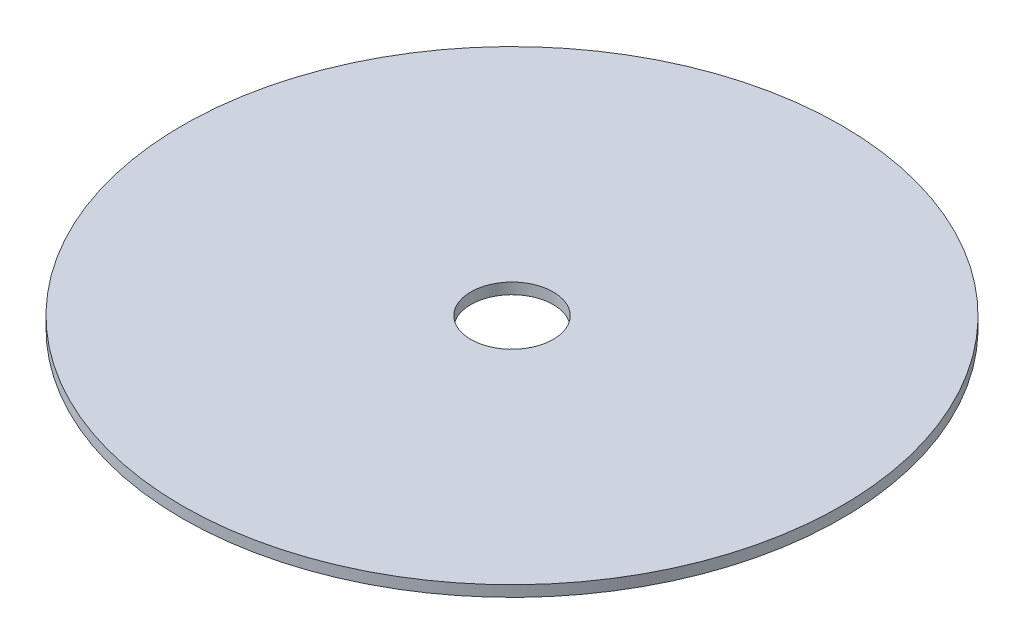
ISO-10303-21;
HEADER;
FILE_DESCRIPTION(('STEP AP214'),'2;1');
FILE_NAME('part.step','',(''),(''),'','','');
FILE_SCHEMA(('AUTOMOTIVE_DESIGN { 1 0 10303 214 1 1 1 1 }'));
ENDSEC;
DATA;
#1=APPLICATION_CONTEXT('core data for automotive mechanical design processes');
#2=APPLICATION_PROTOCOL_DEFINITION('international standard','automotive_design',2000,#1);
#3=PRODUCT_CONTEXT('',#1,'mechanical');
#4=PRODUCT('Part','Part','',(#3));
#5=PRODUCT_RELATED_PRODUCT_CATEGORY('part','',(#4));
#6=PRODUCT_DEFINITION_FORMATION('','',#4);
#7=PRODUCT_DEFINITION_CONTEXT('part definition',#1,'design');
#8=PRODUCT_DEFINITION('design','',#6,#7);
#9=PRODUCT_DEFINITION_SHAPE('','',#8);
#10=(LENGTH_UNIT() NAMED_UNIT(*) SI_UNIT(.MILLI.,.METRE.));
#11=(NAMED_UNIT(*) PLANE_ANGLE_UNIT() SI_UNIT($,.RADIAN.));
#12=(NAMED_UNIT(*) SI_UNIT($,.STERADIAN.) SOLID_ANGLE_UNIT());
#13=UNCERTAINTY_MEASURE_WITH_UNIT(LENGTH_MEASURE(1.E-05),#10,'distance_accuracy_value','');
#14=(GEOMETRIC_REPRESENTATION_CONTEXT(3) GLOBAL_UNCERTAINTY_ASSIGNED_CONTEXT((#13)) GLOBAL_UNIT_ASSIGNED_CONTEXT((#10,
#11,#12)) REPRESENTATION_CONTEXT('',''));
#15=CARTESIAN_POINT('',(0.,0.,0.));
#16=DIRECTION('',(0.,0.,1.));
#17=DIRECTION('',(1.,0.,0.));
#18=AXIS2_PLACEMENT_3D('',#15,#16,#17);
#19=CARTESIAN_POINT('',(0.,18.,0.));
#20=DIRECTION('',(1.,0.,0.));
#21=DIRECTION('',(0.,0.,-1.));
#22=AXIS2_PLACEMENT_3D('',#19,#20,#21);
#23=PLANE('',#22);
#24=DIRECTION('',(0.,0.,1.));
#25=VECTOR('',#24,1.);
#26=CARTESIAN_POINT('',(0.,0.,0.));
#27=LINE('',#26,#25);
#28=CARTESIAN_POINT('',(0.,0.,-18.));
#29=VERTEX_POINT('',#28);
#30=CARTESIAN_POINT('',(0.,0.,0.));
#31=VERTEX_POINT('',#30);
#32=EDGE_CURVE('E96',#29,#31,#27,.T.);
#33=ORIENTED_EDGE('',*,*,#32,.T.);
#34=DIRECTION('',(0.,-1.,0.));
#35=VECTOR('',#34,1.);
#36=CARTESIAN_POINT('',(0.,18.,0.));
#37=LINE('',#36,#35);
#38=CARTESIAN_POINT('',(0.,18.,0.));
#39=VERTEX_POINT('',#38);
#40=EDGE_CURVE('E11',#39,#31,#37,.T.);
#41=ORIENTED_EDGE('',*,*,#40,.F.);
#42=DIRECTION('',(0.,0.,1.));
#43=VECTOR('',#42,1.);
#44=CARTESIAN_POINT('',(0.,18.,0.));
#45=LINE('',#44,#43);
#46=CARTESIAN_POINT('',(0.,18.,-18.));
#47=VERTEX_POINT('',#46);
#48=EDGE_CURVE('E79',#47,#39,#45,.T.);
#49=ORIENTED_EDGE('',*,*,#48,.F.);
#50=DIRECTION('',(0.,-1.,0.));
#51=VECTOR('',#50,1.);
#52=CARTESIAN_POINT('',(0.,18.,-18.));
#53=LINE('',#52,#51);
#54=EDGE_CURVE('E81',#47,#29,#53,.T.);
#55=ORIENTED_EDGE('',*,*,#54,.T.);
#56=EDGE_LOOP('',(#33,#41,#49,#55));
#57=FACE_BOUND('',#56,.T.);
#58=ADVANCED_FACE('F31',(#57),#23,.F.);
#59=CARTESIAN_POINT('',(0.,18.,0.));
#60=DIRECTION('',(0.,0.,-1.));
#61=DIRECTION('',(-1.,0.,0.));
#62=AXIS2_PLACEMENT_3D('',#59,#60,#61);
#63=PLANE('',#62);
#64=DIRECTION('',(1.,0.,0.));
#65=VECTOR('',#64,1.);
#66=CARTESIAN_POINT('',(0.,0.,0.));
#67=LINE('',#66,#65);
#68=CARTESIAN_POINT('',(18.,0.,0.));
#69=VERTEX_POINT('',#68);
#70=EDGE_CURVE('E98',#31,#69,#67,.T.);
#71=ORIENTED_EDGE('',*,*,#70,.T.);
#72=DIRECTION('',(0.,-1.,0.));
#73=VECTOR('',#72,1.);
#74=CARTESIAN_POINT('',(18.,18.,0.));
#75=LINE('',#74,#73);
#76=CARTESIAN_POINT('',(18.,18.,0.));
#77=VERTEX_POINT('',#76);
#78=EDGE_CURVE('E39',#77,#69,#75,.T.);
#79=ORIENTED_EDGE('',*,*,#78,.F.);
#80=DIRECTION('',(1.,0.,0.));
#81=VECTOR('',#80,1.);
#82=CARTESIAN_POINT('',(0.,18.,0.));
#83=LINE('',#82,#81);
#84=EDGE_CURVE('E73',#39,#77,#83,.T.);
#85=ORIENTED_EDGE('',*,*,#84,.F.);
#86=ORIENTED_EDGE('',*,*,#40,.T.);
#87=EDGE_LOOP('',(#71,#79,#85,#86));
#88=FACE_BOUND('',#87,.T.);
#89=ADVANCED_FACE('F106',(#88),#63,.F.);
#90=CARTESIAN_POINT('',(18.,18.,0.));
#91=DIRECTION('',(-1.,0.,0.));
#92=DIRECTION('',(0.,0.,1.));
#93=AXIS2_PLACEMENT_3D('',#90,#91,#92);
#94=PLANE('',#93);
#95=DIRECTION('',(0.,0.,-1.));
#96=VECTOR('',#95,1.);
#97=CARTESIAN_POINT('',(18.,0.,0.));
#98=LINE('',#97,#96);
#99=CARTESIAN_POINT('',(18.,0.,-18.));
#100=VERTEX_POINT('',#99);
#101=EDGE_CURVE('E63',#69,#100,#98,.T.);
#102=ORIENTED_EDGE('',*,*,#101,.T.);
#103=DIRECTION('',(0.,-1.,0.));
#104=VECTOR('',#103,1.);
#105=CARTESIAN_POINT('',(18.,18.,-18.));
#106=LINE('',#105,#104);
#107=CARTESIAN_POINT('',(18.,18.,-18.));
#108=VERTEX_POINT('',#107);
#109=EDGE_CURVE('E47',#108,#100,#106,.T.);
#110=ORIENTED_EDGE('',*,*,#109,.F.);
#111=DIRECTION('',(0.,0.,-1.));
#112=VECTOR('',#111,1.);
#113=CARTESIAN_POINT('',(18.,18.,0.));
#114=LINE('',#113,#112);
#115=EDGE_CURVE('E91',#77,#108,#114,.T.);
#116=ORIENTED_EDGE('',*,*,#115,.F.);
#117=ORIENTED_EDGE('',*,*,#78,.T.);
#118=EDGE_LOOP('',(#102,#110,#116,#117));
#119=FACE_BOUND('',#118,.T.);
#120=ADVANCED_FACE('F103',(#119),#94,.F.);
#121=CARTESIAN_POINT('',(0.,18.,-18.));
#122=DIRECTION('',(0.,0.,1.));
#123=DIRECTION('',(1.,0.,0.));
#124=AXIS2_PLACEMENT_3D('',#121,#122,#123);
#125=PLANE('',#124);
#126=DIRECTION('',(-1.,0.,0.));
#127=VECTOR('',#126,1.);
#128=CARTESIAN_POINT('',(0.,0.,-18.));
#129=LINE('',#128,#127);
#130=EDGE_CURVE('E68',#100,#29,#129,.T.);
#131=ORIENTED_EDGE('',*,*,#130,.T.);
#132=ORIENTED_EDGE('',*,*,#54,.F.);
#133=DIRECTION('',(-1.,0.,0.));
#134=VECTOR('',#133,1.);
#135=CARTESIAN_POINT('',(0.,18.,-18.));
#136=LINE('',#135,#134);
#137=EDGE_CURVE('E87',#108,#47,#136,.T.);
#138=ORIENTED_EDGE('',*,*,#137,.F.);
#139=ORIENTED_EDGE('',*,*,#109,.T.);
#140=EDGE_LOOP('',(#131,#132,#138,#139));
#141=FACE_BOUND('',#140,.T.);
#142=ADVANCED_FACE('F86',(#141),#125,.F.);
#143=CARTESIAN_POINT('',(0.,0.,-18.));
#144=DIRECTION('',(0.,-1.,0.));
#145=DIRECTION('',(0.,0.,-1.));
#146=AXIS2_PLACEMENT_3D('',#143,#144,#145);
#147=PLANE('',#146);
#148=ORIENTED_EDGE('',*,*,#32,.F.);
#149=ORIENTED_EDGE('',*,*,#130,.F.);
#150=ORIENTED_EDGE('',*,*,#101,.F.);
#151=ORIENTED_EDGE('',*,*,#70,.F.);
#152=EDGE_LOOP('',(#148,#149,#150,#151));
#153=FACE_BOUND('',#152,.T.);
#154=ADVANCED_FACE('F105',(#153),#147,.T.);
#155=CARTESIAN_POINT('',(9.00000000000001,18.,31.5));
#156=DIRECTION('',(0.,1.,0.));
#157=DIRECTION('',(0.,0.,1.));
#158=AXIS2_PLACEMENT_3D('',#155,#156,#157);
#159=PLANE('',#158);
#160=CARTESIAN_POINT('',(9.00000000000001,18.,31.5));
#161=DIRECTION('',(0.,1.,0.));
#162=DIRECTION('',(0.,0.,1.));
#163=AXIS2_PLACEMENT_3D('',#160,#161,#162);
#164=CIRCLE('',#163,7.5);
#165=CARTESIAN_POINT('',(9.00000000000001,18.,39.));
#166=VERTEX_POINT('',#165);
#167=EDGE_CURVE('E140',#166,#166,#164,.T.);
#168=ORIENTED_EDGE('',*,*,#167,.T.);
#169=EDGE_LOOP('',(#168));
#170=FACE_BOUND('',#169,.T.);
#171=CARTESIAN_POINT('',(9.00000000000001,18.,31.5));
#172=DIRECTION('',(0.,1.,0.));
#173=DIRECTION('',(0.,0.,1.));
#174=AXIS2_PLACEMENT_3D('',#171,#172,#173);
#175=CIRCLE('',#174,60.);
#176=CARTESIAN_POINT('',(9.00000000000001,18.,91.5));
#177=VERTEX_POINT('',#176);
#178=EDGE_CURVE('E142',#177,#177,#175,.T.);
#179=ORIENTED_EDGE('',*,*,#178,.F.);
#180=EDGE_LOOP('',(#179));
#181=FACE_BOUND('',#180,.T.);
#182=ORIENTED_EDGE('',*,*,#137,.T.);
#183=ORIENTED_EDGE('',*,*,#48,.T.);
#184=ORIENTED_EDGE('',*,*,#84,.T.);
#185=ORIENTED_EDGE('',*,*,#115,.T.);
#186=EDGE_LOOP('',(#182,#183,#184,#185));
#187=FACE_BOUND('',#186,.T.);
#188=ADVANCED_FACE('F90',(#170,#181,#187),#159,.F.);
#189=CARTESIAN_POINT('',(9.00000000000001,20.,31.5));
#190=DIRECTION('',(0.,1.,0.));
#191=DIRECTION('',(0.,0.,1.));
#192=AXIS2_PLACEMENT_3D('',#189,#190,#191);
#193=PLANE('',#192);
#194=CARTESIAN_POINT('',(9.00000000000001,20.,31.5));
#195=DIRECTION('',(0.,1.,0.));
#196=DIRECTION('',(0.,0.,1.));
#197=AXIS2_PLACEMENT_3D('',#194,#195,#196);
#198=CIRCLE('',#197,60.);
#199=CARTESIAN_POINT('',(9.00000000000001,20.,91.5));
#200=VERTEX_POINT('',#199);
#201=EDGE_CURVE('E99',#200,#200,#198,.T.);
#202=ORIENTED_EDGE('',*,*,#201,.T.);
#203=EDGE_LOOP('',(#202));
#204=FACE_BOUND('',#203,.T.);
#205=CARTESIAN_POINT('',(9.00000000000001,20.,31.5));
#206=DIRECTION('',(0.,1.,0.));
#207=DIRECTION('',(0.,0.,1.));
#208=AXIS2_PLACEMENT_3D('',#205,#206,#207);
#209=CIRCLE('',#208,7.5);
#210=CARTESIAN_POINT('',(9.00000000000001,20.,39.));
#211=VERTEX_POINT('',#210);
#212=EDGE_CURVE('E137',#211,#211,#209,.T.);
#213=ORIENTED_EDGE('',*,*,#212,.F.);
#214=EDGE_LOOP('',(#213));
#215=FACE_BOUND('',#214,.T.);
#216=ADVANCED_FACE('F122',(#204,#215),#193,.T.);
#217=CARTESIAN_POINT('',(9.00000000000001,20.,31.5));
#218=DIRECTION('',(0.,-1.,0.));
#219=DIRECTION('',(0.,0.,-1.));
#220=AXIS2_PLACEMENT_3D('',#217,#218,#219);
#221=CYLINDRICAL_SURFACE('',#220,60.);
#222=ORIENTED_EDGE('',*,*,#201,.F.);
#223=EDGE_LOOP('',(#222));
#224=FACE_BOUND('',#223,.T.);
#225=ORIENTED_EDGE('',*,*,#178,.T.);
#226=EDGE_LOOP('',(#225));
#227=FACE_BOUND('',#226,.T.);
#228=ADVANCED_FACE('F118',(#224,#227),#221,.T.);
#229=CARTESIAN_POINT('',(9.00000000000001,20.,31.5));
#230=DIRECTION('',(0.,-1.,0.));
#231=DIRECTION('',(0.,0.,-1.));
#232=AXIS2_PLACEMENT_3D('',#229,#230,#231);
#233=CYLINDRICAL_SURFACE('',#232,7.5);
#234=ORIENTED_EDGE('',*,*,#212,.T.);
#235=EDGE_LOOP('',(#234));
#236=FACE_BOUND('',#235,.T.);
#237=ORIENTED_EDGE('',*,*,#167,.F.);
#238=EDGE_LOOP('',(#237));
#239=FACE_BOUND('',#238,.T.);
#240=ADVANCED_FACE('F121',(#236,#239),#233,.F.);
#241=CLOSED_SHELL('',(#58,#89,#120,#142,#154,#188,#216,#228,#240));
#242=MANIFOLD_SOLID_BREP('B2',#241);
#243=ADVANCED_BREP_SHAPE_REPRESENTATION('',(#18,#242),#14);
#244=SHAPE_DEFINITION_REPRESENTATION(#9,#243);
ENDSEC;
END-ISO-10303-21;
